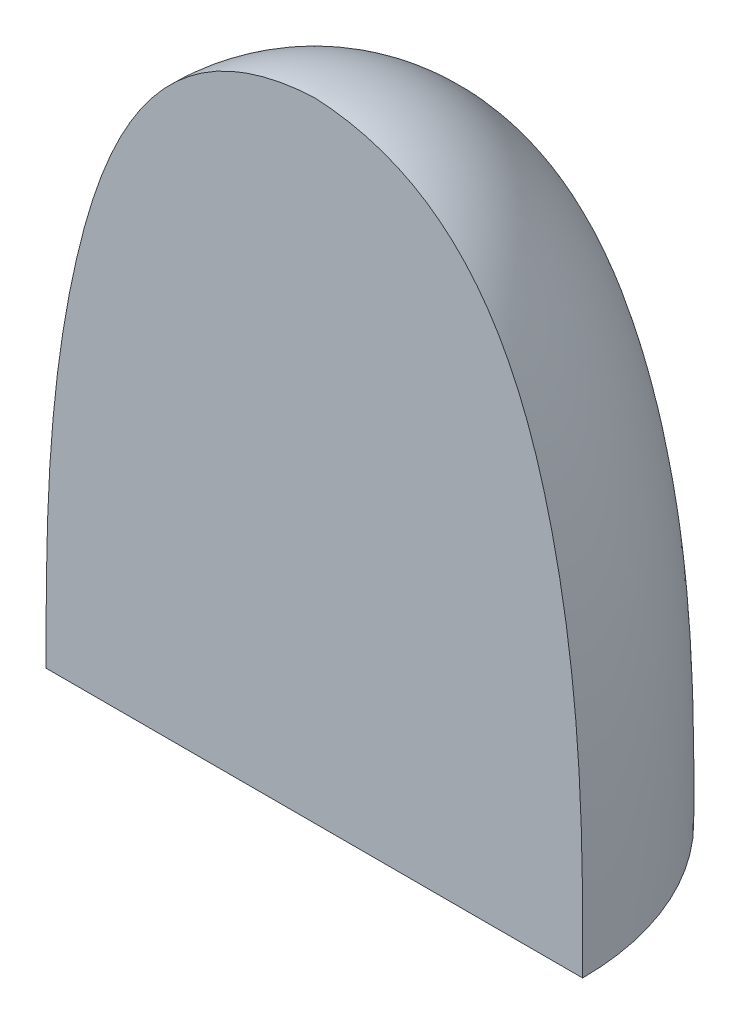
ISO-10303-21;
HEADER;
FILE_DESCRIPTION(('STEP AP214'),'2;1');
FILE_NAME('part.step','',(''),(''),'','','');
FILE_SCHEMA(('AUTOMOTIVE_DESIGN { 1 0 10303 214 1 1 1 1 }'));
ENDSEC;
DATA;
#1=APPLICATION_CONTEXT('core data for automotive mechanical design processes');
#2=APPLICATION_PROTOCOL_DEFINITION('international standard','automotive_design',2000,#1);
#3=PRODUCT_CONTEXT('',#1,'mechanical');
#4=PRODUCT('Part','Part','',(#3));
#5=PRODUCT_RELATED_PRODUCT_CATEGORY('part','',(#4));
#6=PRODUCT_DEFINITION_FORMATION('','',#4);
#7=PRODUCT_DEFINITION_CONTEXT('part definition',#1,'design');
#8=PRODUCT_DEFINITION('design','',#6,#7);
#9=PRODUCT_DEFINITION_SHAPE('','',#8);
#10=(LENGTH_UNIT() NAMED_UNIT(*) SI_UNIT(.MILLI.,.METRE.));
#11=(NAMED_UNIT(*) PLANE_ANGLE_UNIT() SI_UNIT($,.RADIAN.));
#12=(NAMED_UNIT(*) SI_UNIT($,.STERADIAN.) SOLID_ANGLE_UNIT());
#13=UNCERTAINTY_MEASURE_WITH_UNIT(LENGTH_MEASURE(1.E-05),#10,'distance_accuracy_value','');
#14=(GEOMETRIC_REPRESENTATION_CONTEXT(3) GLOBAL_UNCERTAINTY_ASSIGNED_CONTEXT((#13)) GLOBAL_UNIT_ASSIGNED_CONTEXT((#10,
#11,#12)) REPRESENTATION_CONTEXT('',''));
#15=CARTESIAN_POINT('',(0.,0.,0.));
#16=DIRECTION('',(0.,0.,1.));
#17=DIRECTION('',(1.,0.,0.));
#18=AXIS2_PLACEMENT_3D('',#15,#16,#17);
#19=CARTESIAN_POINT('',(0.,13.6694,0.));
#20=CARTESIAN_POINT('',(-3.38206675982998,13.5110575851413,0.));
#21=CARTESIAN_POINT('',(-5.75024953585605,7.9312651419004,0.));
#22=CARTESIAN_POINT('',(-5.84960889358613,2.68237857200598,0.));
#23=CARTESIAN_POINT('',(-5.8345,0.,0.));
#24=B_SPLINE_CURVE_WITH_KNOTS('',3,(#19,#20,#21,#22,#23),.UNSPECIFIED.,.F.,.F.,(4,1,4),(0.,
0.512022228256367,1.),.UNSPECIFIED.);
#25=CARTESIAN_POINT('',(0.,13.6694,0.));
#26=DIRECTION('',(0.,1.,0.));
#27=AXIS1_PLACEMENT('',#25,#26);
#28=SURFACE_OF_REVOLUTION('',#24,#27);
#29=CARTESIAN_POINT('',(0.,13.6694,0.));
#30=CARTESIAN_POINT('',(-3.38206675982998,13.5110575851413,0.));
#31=CARTESIAN_POINT('',(-5.75024953585605,7.9312651419004,0.));
#32=CARTESIAN_POINT('',(-5.84960889358613,2.68237857200598,0.));
#33=CARTESIAN_POINT('',(-5.8345,0.,0.));
#34=B_SPLINE_CURVE_WITH_KNOTS('',3,(#29,#30,#31,#32,#33),.UNSPECIFIED.,.F.,.F.,(4,1,4),(0.,
0.512022228256367,1.),.UNSPECIFIED.);
#35=CARTESIAN_POINT('',(-5.8345,0.,0.));
#36=VERTEX_POINT('',#35);
#37=CARTESIAN_POINT('',(0.,13.6694,0.));
#38=VERTEX_POINT('',#37);
#39=EDGE_CURVE('E74',#36,#38,#34,.F.);
#40=ORIENTED_EDGE('',*,*,#39,.T.);
#41=CARTESIAN_POINT('',(0.,13.6694,0.));
#42=CARTESIAN_POINT('',(3.38206675982998,13.5110575851413,0.));
#43=CARTESIAN_POINT('',(5.75024953585605,7.9312651419004,0.));
#44=CARTESIAN_POINT('',(5.84960889358613,2.68237857200598,0.));
#45=CARTESIAN_POINT('',(5.8345,0.,0.));
#46=B_SPLINE_CURVE_WITH_KNOTS('',3,(#41,#42,#43,#44,#45),.UNSPECIFIED.,.F.,.F.,(4,1,4),(0.,
0.512022228256367,1.),.UNSPECIFIED.);
#47=CARTESIAN_POINT('',(5.8345,0.,0.));
#48=VERTEX_POINT('',#47);
#49=EDGE_CURVE('E79',#38,#48,#46,.T.);
#50=ORIENTED_EDGE('',*,*,#49,.T.);
#51=CARTESIAN_POINT('',(0.,0.,0.));
#52=DIRECTION('',(0.,1.,0.));
#53=DIRECTION('',(-1.,0.,0.));
#54=AXIS2_PLACEMENT_3D('',#51,#52,#53);
#55=CIRCLE('',#54,5.8345);
#56=EDGE_CURVE('E49',#48,#36,#55,.T.);
#57=ORIENTED_EDGE('',*,*,#56,.T.);
#58=EDGE_LOOP('',(#40,#50,#57));
#59=FACE_BOUND('',#58,.T.);
#60=ADVANCED_FACE('F35',(#59),#28,.F.);
#61=CARTESIAN_POINT('',(-5.001,0.,0.));
#62=DIRECTION('',(0.,-1.,0.));
#63=DIRECTION('',(1.,0.,0.));
#64=AXIS2_PLACEMENT_3D('',#61,#62,#63);
#65=PLANE('',#64);
#66=DIRECTION('',(-1.,0.,0.));
#67=VECTOR('',#66,1.);
#68=CARTESIAN_POINT('',(-5.001,0.,0.));
#69=LINE('',#68,#67);
#70=EDGE_CURVE('E67',#48,#36,#69,.T.);
#71=ORIENTED_EDGE('',*,*,#70,.T.);
#72=ORIENTED_EDGE('',*,*,#56,.F.);
#73=EDGE_LOOP('',(#71,#72));
#74=FACE_BOUND('',#73,.T.);
#75=CARTESIAN_POINT('',(0.,0.,0.));
#76=DIRECTION('',(0.,1.,0.));
#77=DIRECTION('',(-1.,0.,0.));
#78=AXIS2_PLACEMENT_3D('',#75,#76,#77);
#79=CIRCLE('',#78,5.001);
#80=CARTESIAN_POINT('',(4.97594222233338,0.,-0.5));
#81=VERTEX_POINT('',#80);
#82=CARTESIAN_POINT('',(-4.97594222233338,0.,-0.5));
#83=VERTEX_POINT('',#82);
#84=EDGE_CURVE('E56',#81,#83,#79,.T.);
#85=ORIENTED_EDGE('',*,*,#84,.T.);
#86=DIRECTION('',(1.,0.,0.));
#87=VECTOR('',#86,1.);
#88=CARTESIAN_POINT('',(-5.41775,0.,-0.5));
#89=LINE('',#88,#87);
#90=EDGE_CURVE('E75',#83,#81,#89,.T.);
#91=ORIENTED_EDGE('',*,*,#90,.T.);
#92=EDGE_LOOP('',(#85,#91));
#93=FACE_BOUND('',#92,.T.);
#94=ADVANCED_FACE('F69',(#74,#93),#65,.T.);
#95=CARTESIAN_POINT('',(-5.001,0.,0.));
#96=CARTESIAN_POINT('',(-4.90878723682861,2.96799188173631,0.));
#97=CARTESIAN_POINT('',(-5.01086996812345,12.0562038944973,0.));
#98=CARTESIAN_POINT('',(0.,12.8359,0.));
#99=B_SPLINE_CURVE_WITH_KNOTS('',3,(#95,#96,#97,#98),.UNSPECIFIED.,.F.,.F.,(4,4),(0.,1.),.UNSPECIFIED.);
#100=CARTESIAN_POINT('',(0.,13.6694,0.));
#101=DIRECTION('',(0.,1.,0.));
#102=AXIS1_PLACEMENT('',#100,#101);
#103=SURFACE_OF_REVOLUTION('',#99,#102);
#104=CARTESIAN_POINT('',(-4.97594222233338,0.,-0.500000000000001));
#105=CARTESIAN_POINT('',(-4.97336327099291,0.0833611183202007,-0.5));
#106=CARTESIAN_POINT('',(-4.97103654779012,0.166729036109077,-0.5));
#107=CARTESIAN_POINT('',(-4.9666571862424,0.333453706253523,-0.5));
#108=CARTESIAN_POINT('',(-4.96460448726368,0.416810456988417,-0.500000000000001));
#109=CARTESIAN_POINT('',(-4.95851116075882,0.666857297413567,-0.500000000000002));
#110=CARTESIAN_POINT('',(-4.95453466996228,0.833548928539558,-0.500000000000001));
#111=CARTESIAN_POINT('',(-4.9458972545062,1.16691382891522,-0.499999999999999));
#112=CARTESIAN_POINT('',(-4.94123633298018,1.33358709824546,-0.5));
#113=CARTESIAN_POINT('',(-4.9254854053235,1.83376620093736,-0.500000000000001));
#114=CARTESIAN_POINT('',(-4.91263087195885,2.16722220112435,-0.500000000000001));
#115=CARTESIAN_POINT('',(-4.88034579445023,2.82376051354111,-0.500000000000001));
#116=CARTESIAN_POINT('',(-4.86112498060621,3.14685276643895,-0.5));
#117=CARTESIAN_POINT('',(-4.81441573766311,3.79248467949087,-0.5));
#118=CARTESIAN_POINT('',(-4.78692650509374,4.11502428287745,-0.5));
#119=CARTESIAN_POINT('',(-4.72197685010742,4.75927931713325,-0.5));
#120=CARTESIAN_POINT('',(-4.68451145014122,5.08099425541663,-0.5));
#121=CARTESIAN_POINT('',(-4.59763172882836,5.72307232683613,-0.5));
#122=CARTESIAN_POINT('',(-4.54820881582951,6.04343431869739,-0.5));
#123=CARTESIAN_POINT('',(-4.435017813023,6.68152954177067,-0.5));
#124=CARTESIAN_POINT('',(-4.37125503115609,6.99926370067877,-0.5));
#125=CARTESIAN_POINT('',(-4.22630467868186,7.63055701437051,-0.5));
#126=CARTESIAN_POINT('',(-4.14513131566564,7.94411935323069,-0.500000000000001));
#127=CARTESIAN_POINT('',(-3.9835020309233,8.48964411874091,-0.5));
#128=CARTESIAN_POINT('',(-3.90764315039423,8.72295962086223,-0.5));
#129=CARTESIAN_POINT('',(-3.74125217448758,9.18427045784327,-0.5));
#130=CARTESIAN_POINT('',(-3.6507259617099,9.41226788384933,-0.5));
#131=CARTESIAN_POINT('',(-3.45262497723547,9.85963937813555,-0.5));
#132=CARTESIAN_POINT('',(-3.3451264765447,10.0790467913232,-0.5));
#133=CARTESIAN_POINT('',(-3.10966539758442,10.5064647356463,-0.5));
#134=CARTESIAN_POINT('',(-2.98172890533063,10.7144893468192,-0.500000000000001));
#135=CARTESIAN_POINT('',(-2.72409135674738,11.0823998748117,-0.500000000000001));
#136=CARTESIAN_POINT('',(-2.59786235634958,11.2446988090505,-0.500000000000001));
#137=CARTESIAN_POINT('',(-2.32687675274932,11.5530248555359,-0.499999999999999));
#138=CARTESIAN_POINT('',(-2.18214332482925,11.6990719011575,-0.499999999999997));
#139=CARTESIAN_POINT('',(-1.95041300838069,11.9023154174824,-0.499999999999998));
#140=CARTESIAN_POINT('',(-1.87044659105968,11.9676119855679,-0.5));
#141=CARTESIAN_POINT('',(-1.7058076788897,12.0920421035416,-0.5));
#142=CARTESIAN_POINT('',(-1.62113460268288,12.1511748894857,-0.5));
#143=CARTESIAN_POINT('',(-1.44707892125899,12.2627058609291,-0.5));
#144=CARTESIAN_POINT('',(-1.35768224054012,12.315082108354,-0.5));
#145=CARTESIAN_POINT('',(-1.17483689336979,12.4121590711196,-0.5));
#146=CARTESIAN_POINT('',(-1.08139003608475,12.45686317015,-0.5));
#147=CARTESIAN_POINT('',(-0.924969517730645,12.523356910304,-0.5));
#148=CARTESIAN_POINT('',(-0.863040382733756,12.5476261018293,-0.5));
#149=CARTESIAN_POINT('',(-0.737811485519198,12.5924054765545,-0.5));
#150=CARTESIAN_POINT('',(-0.674511429927451,12.6129148460929,-0.5));
#151=CARTESIAN_POINT('',(-0.54712458678473,12.6495872669219,-0.5));
#152=CARTESIAN_POINT('',(-0.483046110457879,12.6657790097969,-0.5));
#153=CARTESIAN_POINT('',(-0.353822043262911,12.6931678661833,-0.5));
#154=CARTESIAN_POINT('',(-0.288676960656692,12.7043672907327,-0.500000000000001));
#155=CARTESIAN_POINT('',(-0.178599609318299,12.7178064757966,-0.500000000000001));
#156=CARTESIAN_POINT('',(-0.133879581533347,12.7217672958004,-0.5));
#157=CARTESIAN_POINT('',(-0.0442586364807702,12.7262974463322,-0.5));
#158=CARTESIAN_POINT('',(0.000642282015342263,12.7268667537885,-0.5));
#159=CARTESIAN_POINT('',(0.0903348969047716,12.7245381074606,-0.5));
#160=CARTESIAN_POINT('',(0.135126624271033,12.7216412899518,-0.5));
#161=CARTESIAN_POINT('',(0.224602328756495,12.7127120448661,-0.5));
#162=CARTESIAN_POINT('',(0.269284763802151,12.70666467435,-0.5));
#163=CARTESIAN_POINT('',(0.358232820181157,12.6919103013297,-0.5));
#164=CARTESIAN_POINT('',(0.402498123835383,12.6832014178581,-0.5));
#165=CARTESIAN_POINT('',(0.490537649510917,12.6635109981159,-0.5));
#166=CARTESIAN_POINT('',(0.534311580948963,12.6525281847945,-0.5));
#167=CARTESIAN_POINT('',(0.669026862246259,12.6154300784755,-0.499999999999999));
#168=CARTESIAN_POINT('',(0.759051650232735,12.5859278380508,-0.5));
#169=CARTESIAN_POINT('',(0.936236414875985,12.5195285872653,-0.5));
#170=CARTESIAN_POINT('',(1.02339708960562,12.4826333945913,-0.5));
#171=CARTESIAN_POINT('',(1.28019486501279,12.3617579726023,-0.5));
#172=CARTESIAN_POINT('',(1.44516354902259,12.2675832962288,-0.5));
#173=CARTESIAN_POINT('',(1.70656118455027,12.0923426256871,-0.5));
#174=CARTESIAN_POINT('',(1.80734392978784,12.0175646790499,-0.5));
#175=CARTESIAN_POINT('',(2.0019262465858,11.8593745767041,-0.5));
#176=CARTESIAN_POINT('',(2.09572394813818,11.7759601230493,-0.5));
#177=CARTESIAN_POINT('',(2.3663843376607,11.5147696136504,-0.5));
#178=CARTESIAN_POINT('',(2.53267139880334,11.325937547247,-0.499999999999999));
#179=CARTESIAN_POINT('',(2.80619201089472,10.9704466981055,-0.5));
#180=CARTESIAN_POINT('',(2.91847837399885,10.8075380366168,-0.5));
#181=CARTESIAN_POINT('',(3.12843361812843,10.4724409962116,-0.5));
#182=CARTESIAN_POINT('',(3.22609281390372,10.3002465705206,-0.5));
#183=CARTESIAN_POINT('',(3.40876285880389,9.9486403530358,-0.5));
#184=CARTESIAN_POINT('',(3.49373097265243,9.76920665014135,-0.500000000000001));
#185=CARTESIAN_POINT('',(3.65233438996618,9.40548889030804,-0.499999999999999));
#186=CARTESIAN_POINT('',(3.72597234673822,9.22120598083447,-0.499999999999995));
#187=CARTESIAN_POINT('',(3.85692330271193,8.86664050393117,-0.499999999999995));
#188=CARTESIAN_POINT('',(3.91512150302918,8.6966814458107,-0.499999999999999));
#189=CARTESIAN_POINT('',(4.02442031551564,8.35448055329021,-0.500000000000001));
#190=CARTESIAN_POINT('',(4.07551986774653,8.18223838218293,-0.5));
#191=CARTESIAN_POINT('',(4.17149758086578,7.835763619378,-0.5));
#192=CARTESIAN_POINT('',(4.2163663693436,7.66152844687721,-0.5));
#193=CARTESIAN_POINT('',(4.3004904853284,7.31170202332753,-0.5));
#194=CARTESIAN_POINT('',(4.33974529642406,7.13611064908997,-0.5));
#195=CARTESIAN_POINT('',(4.45005715048776,6.60753746471933,-0.5));
#196=CARTESIAN_POINT('',(4.51360179205479,6.25297923204794,-0.5));
#197=CARTESIAN_POINT('',(4.62477175472113,5.53981627261458,-0.5));
#198=CARTESIAN_POINT('',(4.67232377470549,5.18120049704376,-0.5));
#199=CARTESIAN_POINT('',(4.75404993986775,4.46285078728114,-0.5));
#200=CARTESIAN_POINT('',(4.78823791580347,4.10311839953147,-0.500000000000001));
#201=CARTESIAN_POINT('',(4.84572677791072,3.38288667387217,-0.499999999999999));
#202=CARTESIAN_POINT('',(4.86903001749106,3.0223875186953,-0.499999999999998));
#203=CARTESIAN_POINT('',(4.89975826768239,2.4391221461245,-0.499999999999999));
#204=CARTESIAN_POINT('',(4.90984626863114,2.21648845268383,-0.5));
#205=CARTESIAN_POINT('',(4.92735432966083,1.77109743205832,-0.5));
#206=CARTESIAN_POINT('',(4.93477415499166,1.54834009572117,-0.5));
#207=CARTESIAN_POINT('',(4.94451061473463,1.2150960733314,-0.5));
#208=CARTESIAN_POINT('',(4.94751409851776,1.10462801656722,-0.5));
#209=CARTESIAN_POINT('',(4.95323264756867,0.88368422260611,-0.5));
#210=CARTESIAN_POINT('',(4.95594771235058,0.773208485396544,-0.5));
#211=CARTESIAN_POINT('',(4.96130924957327,0.55227119788965,-0.5));
#212=CARTESIAN_POINT('',(4.9639557317428,0.441809647816453,-0.5));
#213=CARTESIAN_POINT('',(4.96815417476971,0.276123066460942,-0.5));
#214=CARTESIAN_POINT('',(4.96959177349888,0.220895243077641,-0.5));
#215=CARTESIAN_POINT('',(4.97262651552406,0.110443782144481,-0.5));
#216=CARTESIAN_POINT('',(4.97422365950688,0.055220144613664,-0.5));
#217=CARTESIAN_POINT('',(4.97594222233338,0.,-0.500000000000001));
#218=B_SPLINE_CURVE_WITH_KNOTS('',3,(#104,#105,#106,#107,#108,#109,#110,#111,#112,#113,#114,
#115,#116,#117,#118,#119,#120,#121,#122,#123,#124,#125,#126,#127,#128,#129,#130,#131,#132,#133,
#134,#135,#136,#137,#138,#139,#140,#141,#142,#143,#144,#145,#146,#147,#148,#149,#150,#151,#152,
#153,#154,#155,#156,#157,#158,#159,#160,#161,#162,#163,#164,#165,#166,#167,#168,#169,#170,#171,
#172,#173,#174,#175,#176,#177,#178,#179,#180,#181,#182,#183,#184,#185,#186,#187,#188,#189,#190,
#191,#192,#193,#194,#195,#196,#197,#198,#199,#200,#201,#202,#203,#204,#205,#206,#207,#208,#209,
#210,#211,#212,#213,#214,#215,#216,#217),.UNSPECIFIED.,.F.,.F.,(4,2,2,2,2,2,2,2,2,2,2,2,2,2,2,2,
2,2,2,2,2,2,2,2,2,2,2,2,2,2,2,2,2,2,2,2,2,2,2,2,2,2,2,2,2,2,2,2,2,2,2,2,2,2,2,2,4),(0.,
0.250201244674627,0.500347034821478,1.00056373147159,1.50077813805238,2.50183439164612,
3.47273896196457,4.44373790886871,5.4152222406666,6.38740668237798,7.3592318579851,
8.3302669900304,9.06588842462194,9.80121555189821,10.5333276495297,11.2645126743625,
11.8801800279411,12.4950837263958,12.8045583438234,13.1140712722971,13.4245651465517,
13.7349217281098,13.9343634084458,14.1338481990485,14.3319723251153,14.5300046403154,
14.6645792864335,14.7991548480374,14.9336863047615,15.0688617270016,15.2041329033659,
15.3394802558013,15.6232517842368,15.9069536278983,16.4743084030467,16.8503480768839,
17.2264880633213,17.9782020087159,18.5710211486572,19.164231099568,19.7593956186149,
20.354420548644,20.8931913730327,21.4320425579982,21.9716957089618,22.5113984689592,
23.591494490289,24.6764756590227,25.7603309638633,26.8439518177618,27.5125225665618,
28.1811521228409,28.5126786124078,28.8442056604689,29.1756854196468,29.341424820393,
29.5071649346324),.UNSPECIFIED.);
#219=EDGE_CURVE('E11',#83,#81,#218,.T.);
#220=ORIENTED_EDGE('',*,*,#219,.F.);
#221=ORIENTED_EDGE('',*,*,#84,.F.);
#222=EDGE_LOOP('',(#220,#221));
#223=FACE_BOUND('',#222,.T.);
#224=ADVANCED_FACE('F94',(#223),#103,.F.);
#225=CARTESIAN_POINT('',(0.,0.,0.));
#226=DIRECTION('',(0.,0.,1.));
#227=DIRECTION('',(1.,0.,0.));
#228=AXIS2_PLACEMENT_3D('',#225,#226,#227);
#229=PLANE('',#228);
#230=ORIENTED_EDGE('',*,*,#39,.F.);
#231=ORIENTED_EDGE('',*,*,#70,.F.);
#232=ORIENTED_EDGE('',*,*,#49,.F.);
#233=EDGE_LOOP('',(#230,#231,#232));
#234=FACE_BOUND('',#233,.T.);
#235=ADVANCED_FACE('F78',(#234),#229,.T.);
#236=CARTESIAN_POINT('',(0.0575784492502523,13.3863096269332,-0.5));
#237=DIRECTION('',(0.,0.,-1.));
#238=DIRECTION('',(-1.,0.,0.));
#239=AXIS2_PLACEMENT_3D('',#236,#237,#238);
#240=PLANE('',#239);
#241=ORIENTED_EDGE('',*,*,#90,.F.);
#242=ORIENTED_EDGE('',*,*,#219,.T.);
#243=EDGE_LOOP('',(#241,#242));
#244=FACE_BOUND('',#243,.T.);
#245=ADVANCED_FACE('F125',(#244),#240,.T.);
#246=CLOSED_SHELL('',(#60,#94,#224,#235,#245));
#247=MANIFOLD_SOLID_BREP('B2',#246);
#248=ADVANCED_BREP_SHAPE_REPRESENTATION('',(#18,#247),#14);
#249=SHAPE_DEFINITION_REPRESENTATION(#9,#248);
ENDSEC;
END-ISO-10303-21;
